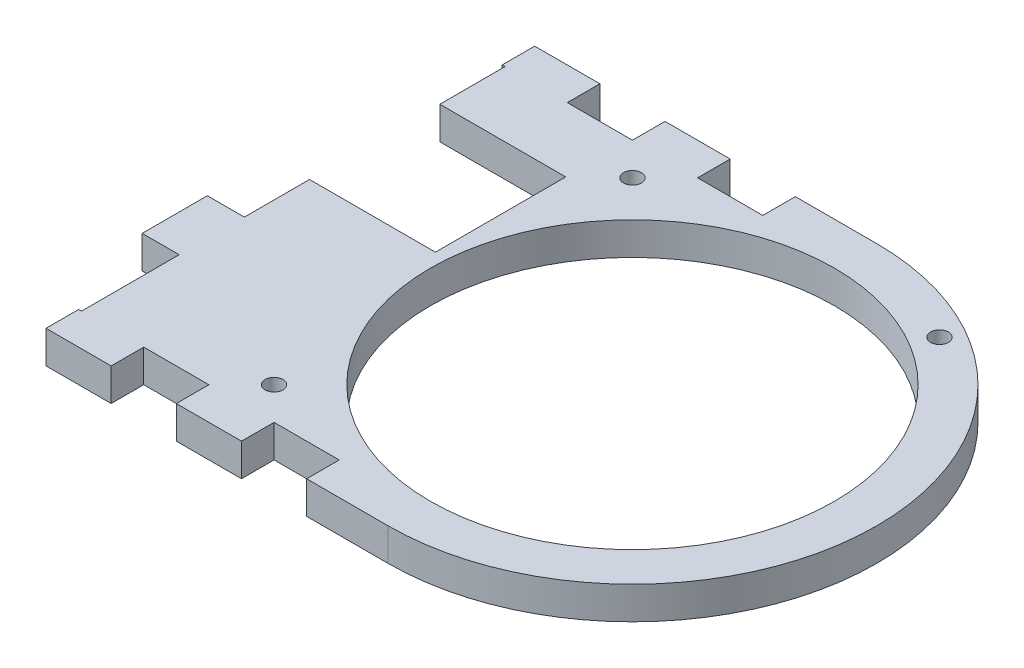
ISO-10303-21;
HEADER;
FILE_DESCRIPTION(('STEP AP214'),'2;1');
FILE_NAME('part.step','',(''),(''),'','','');
FILE_SCHEMA(('AUTOMOTIVE_DESIGN { 1 0 10303 214 1 1 1 1 }'));
ENDSEC;
DATA;
#1=APPLICATION_CONTEXT('core data for automotive mechanical design processes');
#2=APPLICATION_PROTOCOL_DEFINITION('international standard','automotive_design',2000,#1);
#3=PRODUCT_CONTEXT('',#1,'mechanical');
#4=PRODUCT('Part','Part','',(#3));
#5=PRODUCT_RELATED_PRODUCT_CATEGORY('part','',(#4));
#6=PRODUCT_DEFINITION_FORMATION('','',#4);
#7=PRODUCT_DEFINITION_CONTEXT('part definition',#1,'design');
#8=PRODUCT_DEFINITION('design','',#6,#7);
#9=PRODUCT_DEFINITION_SHAPE('','',#8);
#10=(LENGTH_UNIT() NAMED_UNIT(*) SI_UNIT(.MILLI.,.METRE.));
#11=(NAMED_UNIT(*) PLANE_ANGLE_UNIT() SI_UNIT($,.RADIAN.));
#12=(NAMED_UNIT(*) SI_UNIT($,.STERADIAN.) SOLID_ANGLE_UNIT());
#13=UNCERTAINTY_MEASURE_WITH_UNIT(LENGTH_MEASURE(1.E-05),#10,'distance_accuracy_value','');
#14=(GEOMETRIC_REPRESENTATION_CONTEXT(3) GLOBAL_UNCERTAINTY_ASSIGNED_CONTEXT((#13)) GLOBAL_UNIT_ASSIGNED_CONTEXT((#10,
#11,#12)) REPRESENTATION_CONTEXT('',''));
#15=CARTESIAN_POINT('',(0.,0.,0.));
#16=DIRECTION('',(0.,0.,1.));
#17=DIRECTION('',(1.,0.,0.));
#18=AXIS2_PLACEMENT_3D('',#15,#16,#17);
#19=CARTESIAN_POINT('',(0.,0.,95.25));
#20=DIRECTION('',(0.,0.,1.));
#21=DIRECTION('',(1.,0.,0.));
#22=AXIS2_PLACEMENT_3D('',#19,#20,#21);
#23=PLANE('',#22);
#24=DIRECTION('',(0.,1.,0.));
#25=VECTOR('',#24,1.);
#26=CARTESIAN_POINT('',(44.9585417845309,0.,95.250000000014));
#27=LINE('',#26,#25);
#28=CARTESIAN_POINT('',(44.9585417845309,0.,95.250000000014));
#29=VERTEX_POINT('',#28);
#30=CARTESIAN_POINT('',(44.9585417845309,6.34999999999999,95.250000000014));
#31=VERTEX_POINT('',#30);
#32=EDGE_CURVE('E438',#29,#31,#27,.T.);
#33=ORIENTED_EDGE('',*,*,#32,.F.);
#34=DIRECTION('',(1.,0.,0.));
#35=VECTOR('',#34,1.);
#36=CARTESIAN_POINT('',(159.258541784531,0.,95.25));
#37=LINE('',#36,#35);
#38=CARTESIAN_POINT('',(57.6585417845309,0.,95.250000000007));
#39=VERTEX_POINT('',#38);
#40=EDGE_CURVE('E265',#29,#39,#37,.T.);
#41=ORIENTED_EDGE('',*,*,#40,.T.);
#42=DIRECTION('',(0.,1.,0.));
#43=VECTOR('',#42,1.);
#44=CARTESIAN_POINT('',(57.6585417845309,0.,95.250000000007));
#45=LINE('',#44,#43);
#46=CARTESIAN_POINT('',(57.6585417845309,6.34999999999999,95.250000000007));
#47=VERTEX_POINT('',#46);
#48=EDGE_CURVE('E401',#39,#47,#45,.T.);
#49=ORIENTED_EDGE('',*,*,#48,.T.);
#50=DIRECTION('',(-1.,0.,0.));
#51=VECTOR('',#50,1.);
#52=CARTESIAN_POINT('',(159.258541784531,6.35,95.25));
#53=LINE('',#52,#51);
#54=EDGE_CURVE('E272',#47,#31,#53,.T.);
#55=ORIENTED_EDGE('',*,*,#54,.T.);
#56=EDGE_LOOP('',(#33,#41,#49,#55));
#57=FACE_BOUND('',#56,.T.);
#58=ADVANCED_FACE('F33',(#57),#23,.T.);
#59=CARTESIAN_POINT('',(0.,0.,0.));
#60=DIRECTION('',(0.,0.,1.));
#61=DIRECTION('',(1.,0.,0.));
#62=AXIS2_PLACEMENT_3D('',#59,#60,#61);
#63=PLANE('',#62);
#64=DIRECTION('',(1.,0.,0.));
#65=VECTOR('',#64,1.);
#66=CARTESIAN_POINT('',(159.258541784531,0.,0.));
#67=LINE('',#66,#65);
#68=CARTESIAN_POINT('',(70.3585417845309,0.,-5.33004317040475E-12));
#69=VERTEX_POINT('',#68);
#70=CARTESIAN_POINT('',(83.0585417845309,0.,0.));
#71=VERTEX_POINT('',#70);
#72=EDGE_CURVE('E273',#69,#71,#67,.T.);
#73=ORIENTED_EDGE('',*,*,#72,.F.);
#74=DIRECTION('',(0.,1.,0.));
#75=VECTOR('',#74,1.);
#76=CARTESIAN_POINT('',(70.3585417845309,0.,-5.33004317040475E-12));
#77=LINE('',#76,#75);
#78=CARTESIAN_POINT('',(70.3585417845309,6.34999999999999,-5.33004317040475E-12));
#79=VERTEX_POINT('',#78);
#80=EDGE_CURVE('E375',#69,#79,#77,.T.);
#81=ORIENTED_EDGE('',*,*,#80,.T.);
#82=DIRECTION('',(-1.,0.,0.));
#83=VECTOR('',#82,1.);
#84=CARTESIAN_POINT('',(159.258541784531,6.35,0.));
#85=LINE('',#84,#83);
#86=CARTESIAN_POINT('',(83.0585417845309,6.34999999999999,-1.23219202719043E-11));
#87=VERTEX_POINT('',#86);
#88=EDGE_CURVE('E277',#87,#79,#85,.T.);
#89=ORIENTED_EDGE('',*,*,#88,.F.);
#90=DIRECTION('',(0.,1.,0.));
#91=VECTOR('',#90,1.);
#92=CARTESIAN_POINT('',(83.0585417845309,0.,-1.23219202719043E-11));
#93=LINE('',#92,#91);
#94=EDGE_CURVE('E326',#71,#87,#93,.T.);
#95=ORIENTED_EDGE('',*,*,#94,.F.);
#96=EDGE_LOOP('',(#73,#81,#89,#95));
#97=FACE_BOUND('',#96,.T.);
#98=ADVANCED_FACE('F596',(#97),#63,.F.);
#99=DIRECTION('',(0.,1.,0.));
#100=VECTOR('',#99,1.);
#101=CARTESIAN_POINT('',(70.3585417845309,0.,95.250000000007));
#102=LINE('',#101,#100);
#103=CARTESIAN_POINT('',(70.3585417845309,0.,95.250000000007));
#104=VERTEX_POINT('',#103);
#105=CARTESIAN_POINT('',(70.3585417845309,6.34999999999999,95.250000000007));
#106=VERTEX_POINT('',#105);
#107=EDGE_CURVE('E404',#104,#106,#102,.T.);
#108=ORIENTED_EDGE('',*,*,#107,.F.);
#109=CARTESIAN_POINT('',(83.0585417845309,0.,95.25));
#110=VERTEX_POINT('',#109);
#111=EDGE_CURVE('E266',#104,#110,#37,.T.);
#112=ORIENTED_EDGE('',*,*,#111,.T.);
#113=DIRECTION('',(0.,1.,0.));
#114=VECTOR('',#113,1.);
#115=CARTESIAN_POINT('',(83.0585417845309,0.,95.25));
#116=LINE('',#115,#114);
#117=CARTESIAN_POINT('',(83.0585417845309,6.34999999999999,95.25));
#118=VERTEX_POINT('',#117);
#119=EDGE_CURVE('E349',#110,#118,#116,.T.);
#120=ORIENTED_EDGE('',*,*,#119,.T.);
#121=EDGE_CURVE('E283',#118,#106,#53,.T.);
#122=ORIENTED_EDGE('',*,*,#121,.T.);
#123=EDGE_LOOP('',(#108,#112,#120,#122));
#124=FACE_BOUND('',#123,.T.);
#125=ADVANCED_FACE('F563',(#124),#23,.T.);
#126=CARTESIAN_POINT('',(95.7585417845309,0.,-1.23234755733392E-11));
#127=VERTEX_POINT('',#126);
#128=CARTESIAN_POINT('',(111.633541784531,0.,0.));
#129=VERTEX_POINT('',#128);
#130=EDGE_CURVE('E274',#127,#129,#67,.T.);
#131=ORIENTED_EDGE('',*,*,#130,.F.);
#132=DIRECTION('',(0.,1.,0.));
#133=VECTOR('',#132,1.);
#134=CARTESIAN_POINT('',(95.7585417845309,0.,-1.23234755733392E-11));
#135=LINE('',#134,#133);
#136=CARTESIAN_POINT('',(95.7585417845309,6.34999999999999,-1.23234755733392E-11));
#137=VERTEX_POINT('',#136);
#138=EDGE_CURVE('E323',#127,#137,#135,.T.);
#139=ORIENTED_EDGE('',*,*,#138,.T.);
#140=CARTESIAN_POINT('',(111.633541784531,6.34999999999999,-1.23234755733392E-11));
#141=VERTEX_POINT('',#140);
#142=EDGE_CURVE('E275',#141,#137,#85,.T.);
#143=ORIENTED_EDGE('',*,*,#142,.F.);
#144=DIRECTION('',(0.,1.,0.));
#145=VECTOR('',#144,1.);
#146=CARTESIAN_POINT('',(111.633541784531,0.,-1.23234755733392E-11));
#147=LINE('',#146,#145);
#148=EDGE_CURVE('E288',#129,#141,#147,.T.);
#149=ORIENTED_EDGE('',*,*,#148,.F.);
#150=EDGE_LOOP('',(#131,#139,#143,#149));
#151=FACE_BOUND('',#150,.T.);
#152=ADVANCED_FACE('F517',(#151),#63,.F.);
#153=CARTESIAN_POINT('',(159.258541784531,6.35,95.25));
#154=DIRECTION('',(0.,-1.,0.));
#155=DIRECTION('',(1.,0.,0.));
#156=AXIS2_PLACEMENT_3D('',#153,#154,#155);
#157=PLANE('',#156);
#158=CARTESIAN_POINT('',(133.541041784534,6.35,9.68009693317952));
#159=DIRECTION('',(0.,1.,0.));
#160=DIRECTION('',(-1.,0.,0.));
#161=AXIS2_PLACEMENT_3D('',#158,#159,#160);
#162=CIRCLE('',#161,1.75000000000001);
#163=CARTESIAN_POINT('',(131.791041784534,6.35,9.68009693317952));
#164=VERTEX_POINT('',#163);
#165=EDGE_CURVE('E500',#164,#164,#162,.T.);
#166=ORIENTED_EDGE('',*,*,#165,.F.);
#167=EDGE_LOOP('',(#166));
#168=FACE_BOUND('',#167,.T.);
#169=CARTESIAN_POINT('',(76.7085417845309,6.34999999999999,82.55));
#170=DIRECTION('',(0.,1.,0.));
#171=DIRECTION('',(-1.,0.,0.));
#172=AXIS2_PLACEMENT_3D('',#169,#170,#171);
#173=CIRCLE('',#172,1.75);
#174=CARTESIAN_POINT('',(74.9585417845309,6.34999999999999,82.55));
#175=VERTEX_POINT('',#174);
#176=EDGE_CURVE('E494',#175,#175,#173,.T.);
#177=ORIENTED_EDGE('',*,*,#176,.F.);
#178=EDGE_LOOP('',(#177));
#179=FACE_BOUND('',#178,.T.);
#180=CARTESIAN_POINT('',(76.7085417845309,6.34999999999999,12.7));
#181=DIRECTION('',(0.,1.,0.));
#182=DIRECTION('',(-1.,0.,0.));
#183=AXIS2_PLACEMENT_3D('',#180,#181,#182);
#184=CIRCLE('',#183,1.75);
#185=CARTESIAN_POINT('',(74.9585417845309,6.34999999999999,12.7));
#186=VERTEX_POINT('',#185);
#187=EDGE_CURVE('E488',#186,#186,#184,.T.);
#188=ORIENTED_EDGE('',*,*,#187,.F.);
#189=EDGE_LOOP('',(#188));
#190=FACE_BOUND('',#189,.T.);
#191=CARTESIAN_POINT('',(111.633541784531,6.34999999999999,47.625));
#192=DIRECTION('',(0.,1.,0.));
#193=DIRECTION('',(-1.,0.,0.));
#194=AXIS2_PLACEMENT_3D('',#191,#192,#193);
#195=CIRCLE('',#194,39.37);
#196=CARTESIAN_POINT('',(72.2635417845309,6.34999999999999,47.625));
#197=VERTEX_POINT('',#196);
#198=EDGE_CURVE('E284',#197,#197,#195,.T.);
#199=ORIENTED_EDGE('',*,*,#198,.F.);
#200=EDGE_LOOP('',(#199));
#201=FACE_BOUND('',#200,.T.);
#202=DIRECTION('',(1.,0.,0.));
#203=VECTOR('',#202,1.);
#204=CARTESIAN_POINT('',(38.3055854572426,6.34999999999999,44.45));
#205=LINE('',#204,#203);
#206=CARTESIAN_POINT('',(45.5181771869598,6.34999999999999,44.45));
#207=VERTEX_POINT('',#206);
#208=CARTESIAN_POINT('',(70.0555854572427,6.34999999999999,44.45));
#209=VERTEX_POINT('',#208);
#210=EDGE_CURVE('E314',#207,#209,#205,.T.);
#211=ORIENTED_EDGE('',*,*,#210,.F.);
#212=DIRECTION('',(0.,0.,-1.));
#213=VECTOR('',#212,1.);
#214=CARTESIAN_POINT('',(45.5181771869598,6.34999999999999,57.150000000007));
#215=LINE('',#214,#213);
#216=CARTESIAN_POINT('',(45.5181771869598,6.34999999999999,57.150000000007));
#217=VERTEX_POINT('',#216);
#218=EDGE_CURVE('E48',#217,#207,#215,.T.);
#219=ORIENTED_EDGE('',*,*,#218,.F.);
#220=DIRECTION('',(1.,0.,0.));
#221=VECTOR('',#220,1.);
#222=CARTESIAN_POINT('',(38.3055854572427,6.34999999999999,57.150000000007));
#223=LINE('',#222,#221);
#224=CARTESIAN_POINT('',(38.3055854572427,6.34999999999999,57.150000000007));
#225=VERTEX_POINT('',#224);
#226=EDGE_CURVE('E484',#225,#217,#223,.T.);
#227=ORIENTED_EDGE('',*,*,#226,.F.);
#228=DIRECTION('',(0.,0.,-1.));
#229=VECTOR('',#228,1.);
#230=CARTESIAN_POINT('',(38.3055854572427,6.34999999999999,95.25));
#231=LINE('',#230,#229);
#232=CARTESIAN_POINT('',(38.3055854572427,6.34999999999999,69.850000000007));
#233=VERTEX_POINT('',#232);
#234=EDGE_CURVE('E11',#233,#225,#231,.T.);
#235=ORIENTED_EDGE('',*,*,#234,.F.);
#236=DIRECTION('',(-1.,0.,0.));
#237=VECTOR('',#236,1.);
#238=CARTESIAN_POINT('',(38.3055854572427,6.34999999999999,69.850000000007));
#239=LINE('',#238,#237);
#240=CARTESIAN_POINT('',(45.5181771869598,6.34999999999999,69.850000000007));
#241=VERTEX_POINT('',#240);
#242=EDGE_CURVE('E469',#241,#233,#239,.T.);
#243=ORIENTED_EDGE('',*,*,#242,.F.);
#244=DIRECTION('',(0.,0.,-1.));
#245=VECTOR('',#244,1.);
#246=CARTESIAN_POINT('',(45.5181771869598,6.34999999999999,88.900000000014));
#247=LINE('',#246,#245);
#248=CARTESIAN_POINT('',(45.5181771869598,6.34999999999999,88.900000000014));
#249=VERTEX_POINT('',#248);
#250=EDGE_CURVE('E471',#249,#241,#247,.T.);
#251=ORIENTED_EDGE('',*,*,#250,.F.);
#252=DIRECTION('',(1.,0.,0.));
#253=VECTOR('',#252,1.);
#254=CARTESIAN_POINT('',(38.3055854572427,6.34999999999999,88.900000000014));
#255=LINE('',#254,#253);
#256=CARTESIAN_POINT('',(44.9585417845309,6.34999999999999,88.900000000014));
#257=VERTEX_POINT('',#256);
#258=EDGE_CURVE('E474',#257,#249,#255,.T.);
#259=ORIENTED_EDGE('',*,*,#258,.F.);
#260=DIRECTION('',(0.,0.,-1.));
#261=VECTOR('',#260,1.);
#262=CARTESIAN_POINT('',(44.9585417845309,6.34999999999999,95.250000000014));
#263=LINE('',#262,#261);
#264=EDGE_CURVE('E442',#31,#257,#263,.T.);
#265=ORIENTED_EDGE('',*,*,#264,.F.);
#266=ORIENTED_EDGE('',*,*,#54,.F.);
#267=DIRECTION('',(0.,0.,1.));
#268=VECTOR('',#267,1.);
#269=CARTESIAN_POINT('',(57.6585417845309,6.34999999999999,95.250000000007));
#270=LINE('',#269,#268);
#271=CARTESIAN_POINT('',(57.6585417845309,6.34999999999999,88.900000000007));
#272=VERTEX_POINT('',#271);
#273=EDGE_CURVE('E417',#272,#47,#270,.T.);
#274=ORIENTED_EDGE('',*,*,#273,.F.);
#275=DIRECTION('',(-1.,0.,0.));
#276=VECTOR('',#275,1.);
#277=CARTESIAN_POINT('',(57.6585417845309,6.34999999999999,88.900000000007));
#278=LINE('',#277,#276);
#279=CARTESIAN_POINT('',(70.3585417845309,6.34999999999999,88.900000000007));
#280=VERTEX_POINT('',#279);
#281=EDGE_CURVE('E410',#280,#272,#278,.T.);
#282=ORIENTED_EDGE('',*,*,#281,.F.);
#283=DIRECTION('',(0.,0.,-1.));
#284=VECTOR('',#283,1.);
#285=CARTESIAN_POINT('',(70.3585417845309,6.34999999999999,95.250000000007));
#286=LINE('',#285,#284);
#287=EDGE_CURVE('E414',#106,#280,#286,.T.);
#288=ORIENTED_EDGE('',*,*,#287,.F.);
#289=ORIENTED_EDGE('',*,*,#121,.F.);
#290=DIRECTION('',(0.,0.,1.));
#291=VECTOR('',#290,1.);
#292=CARTESIAN_POINT('',(83.0585417845309,6.34999999999999,95.25));
#293=LINE('',#292,#291);
#294=CARTESIAN_POINT('',(83.0585417845309,6.34999999999999,88.9));
#295=VERTEX_POINT('',#294);
#296=EDGE_CURVE('E365',#295,#118,#293,.T.);
#297=ORIENTED_EDGE('',*,*,#296,.F.);
#298=DIRECTION('',(-1.,0.,0.));
#299=VECTOR('',#298,1.);
#300=CARTESIAN_POINT('',(83.0585417845309,6.34999999999999,88.9));
#301=LINE('',#300,#299);
#302=CARTESIAN_POINT('',(95.7585417845309,6.34999999999999,88.9));
#303=VERTEX_POINT('',#302);
#304=EDGE_CURVE('E358',#303,#295,#301,.T.);
#305=ORIENTED_EDGE('',*,*,#304,.F.);
#306=DIRECTION('',(0.,0.,-1.));
#307=VECTOR('',#306,1.);
#308=CARTESIAN_POINT('',(95.7585417845309,6.34999999999999,95.25));
#309=LINE('',#308,#307);
#310=CARTESIAN_POINT('',(95.7585417845309,6.34999999999999,95.25));
#311=VERTEX_POINT('',#310);
#312=EDGE_CURVE('E362',#311,#303,#309,.T.);
#313=ORIENTED_EDGE('',*,*,#312,.F.);
#314=CARTESIAN_POINT('',(111.633541784531,6.34999999999999,95.25));
#315=VERTEX_POINT('',#314);
#316=EDGE_CURVE('E280',#315,#311,#53,.T.);
#317=ORIENTED_EDGE('',*,*,#316,.F.);
#318=CARTESIAN_POINT('',(111.633541784531,6.34999999999999,47.625));
#319=DIRECTION('',(0.,-1.,0.));
#320=DIRECTION('',(-1.,0.,0.));
#321=AXIS2_PLACEMENT_3D('',#318,#319,#320);
#322=CIRCLE('',#321,47.6250000000062);
#323=EDGE_CURVE('E297',#141,#315,#322,.T.);
#324=ORIENTED_EDGE('',*,*,#323,.F.);
#325=ORIENTED_EDGE('',*,*,#142,.T.);
#326=DIRECTION('',(0.,0.,-1.));
#327=VECTOR('',#326,1.);
#328=CARTESIAN_POINT('',(95.7585417845309,6.34999999999999,-1.23234755733392E-11));
#329=LINE('',#328,#327);
#330=CARTESIAN_POINT('',(95.7585417845309,6.34999999999999,6.34999999998768));
#331=VERTEX_POINT('',#330);
#332=EDGE_CURVE('E339',#331,#137,#329,.T.);
#333=ORIENTED_EDGE('',*,*,#332,.F.);
#334=DIRECTION('',(1.,0.,0.));
#335=VECTOR('',#334,1.);
#336=CARTESIAN_POINT('',(95.7585417845309,6.34999999999999,6.34999999998768));
#337=LINE('',#336,#335);
#338=CARTESIAN_POINT('',(83.0585417845309,6.34999999999999,6.34999999998768));
#339=VERTEX_POINT('',#338);
#340=EDGE_CURVE('E332',#339,#331,#337,.T.);
#341=ORIENTED_EDGE('',*,*,#340,.F.);
#342=DIRECTION('',(0.,0.,1.));
#343=VECTOR('',#342,1.);
#344=CARTESIAN_POINT('',(83.0585417845309,6.34999999999999,-1.23219202719043E-11));
#345=LINE('',#344,#343);
#346=EDGE_CURVE('E336',#87,#339,#345,.T.);
#347=ORIENTED_EDGE('',*,*,#346,.F.);
#348=ORIENTED_EDGE('',*,*,#88,.T.);
#349=DIRECTION('',(0.,0.,-1.));
#350=VECTOR('',#349,1.);
#351=CARTESIAN_POINT('',(70.3585417845309,6.34999999999999,-5.33004317040475E-12));
#352=LINE('',#351,#350);
#353=CARTESIAN_POINT('',(70.3585417845309,6.34999999999999,6.34999999999467));
#354=VERTEX_POINT('',#353);
#355=EDGE_CURVE('E391',#354,#79,#352,.T.);
#356=ORIENTED_EDGE('',*,*,#355,.F.);
#357=DIRECTION('',(1.,0.,0.));
#358=VECTOR('',#357,1.);
#359=CARTESIAN_POINT('',(70.3585417845309,6.34999999999999,6.34999999999467));
#360=LINE('',#359,#358);
#361=CARTESIAN_POINT('',(57.6585417845309,6.34999999999999,6.34999999999467));
#362=VERTEX_POINT('',#361);
#363=EDGE_CURVE('E384',#362,#354,#360,.T.);
#364=ORIENTED_EDGE('',*,*,#363,.F.);
#365=DIRECTION('',(0.,0.,1.));
#366=VECTOR('',#365,1.);
#367=CARTESIAN_POINT('',(57.6585417845309,6.34999999999999,-5.32848786896983E-12));
#368=LINE('',#367,#366);
#369=CARTESIAN_POINT('',(57.6585417845309,6.34999999999999,-5.32848786896983E-12));
#370=VERTEX_POINT('',#369);
#371=EDGE_CURVE('E388',#370,#362,#368,.T.);
#372=ORIENTED_EDGE('',*,*,#371,.F.);
#373=CARTESIAN_POINT('',(44.9585417845309,6.34999999999999,0.));
#374=VERTEX_POINT('',#373);
#375=EDGE_CURVE('E278',#370,#374,#85,.T.);
#376=ORIENTED_EDGE('',*,*,#375,.T.);
#377=DIRECTION('',(0.,0.,-1.));
#378=VECTOR('',#377,1.);
#379=CARTESIAN_POINT('',(44.9585417845309,6.34999999999999,1.66338923252974E-12));
#380=LINE('',#379,#378);
#381=CARTESIAN_POINT('',(44.9585417845309,6.34999999999999,6.35000000000166));
#382=VERTEX_POINT('',#381);
#383=EDGE_CURVE('E433',#382,#374,#380,.T.);
#384=ORIENTED_EDGE('',*,*,#383,.F.);
#385=DIRECTION('',(-1.,0.,0.));
#386=VECTOR('',#385,1.);
#387=CARTESIAN_POINT('',(38.3055854572427,6.34999999999999,6.35000000000166));
#388=LINE('',#387,#386);
#389=CARTESIAN_POINT('',(45.5181771869598,6.34999999999999,6.35000000000166));
#390=VERTEX_POINT('',#389);
#391=EDGE_CURVE('E452',#390,#382,#388,.T.);
#392=ORIENTED_EDGE('',*,*,#391,.F.);
#393=DIRECTION('',(0.,0.,-1.));
#394=VECTOR('',#393,1.);
#395=CARTESIAN_POINT('',(45.5181771869598,6.34999999999999,6.35000000000166));
#396=LINE('',#395,#394);
#397=CARTESIAN_POINT('',(45.5181771869598,6.34999999999999,19.05));
#398=VERTEX_POINT('',#397);
#399=EDGE_CURVE('E455',#398,#390,#396,.T.);
#400=ORIENTED_EDGE('',*,*,#399,.F.);
#401=DIRECTION('',(-1.,0.,0.));
#402=VECTOR('',#401,1.);
#403=CARTESIAN_POINT('',(38.3055854572427,6.34999999999999,19.05));
#404=LINE('',#403,#402);
#405=CARTESIAN_POINT('',(70.0555854572427,6.34999999999999,19.05));
#406=VERTEX_POINT('',#405);
#407=EDGE_CURVE('E307',#406,#398,#404,.T.);
#408=ORIENTED_EDGE('',*,*,#407,.F.);
#409=DIRECTION('',(0.,0.,-1.));
#410=VECTOR('',#409,1.);
#411=CARTESIAN_POINT('',(70.0555854572427,6.34999999999999,19.05));
#412=LINE('',#411,#410);
#413=EDGE_CURVE('E311',#209,#406,#412,.T.);
#414=ORIENTED_EDGE('',*,*,#413,.F.);
#415=EDGE_LOOP('',(#211,#219,#227,#235,#243,#251,#259,#265,#266,#274,#282,#288,#289,#297,#305,
#313,#317,#324,#325,#333,#341,#347,#348,#356,#364,#372,#376,#384,#392,#400,#408,#414));
#416=FACE_BOUND('',#415,.T.);
#417=ADVANCED_FACE('F35',(#168,#179,#190,#201,#416),#157,.F.);
#418=CARTESIAN_POINT('',(38.3055854572427,0.,95.25));
#419=DIRECTION('',(1.,0.,0.));
#420=DIRECTION('',(0.,0.,-1.));
#421=AXIS2_PLACEMENT_3D('',#418,#419,#420);
#422=PLANE('',#421);
#423=ORIENTED_EDGE('',*,*,#234,.T.);
#424=DIRECTION('',(0.,1.,0.));
#425=VECTOR('',#424,1.);
#426=CARTESIAN_POINT('',(38.3055854572427,0.,57.150000000007));
#427=LINE('',#426,#425);
#428=CARTESIAN_POINT('',(38.3055854572427,0.,57.150000000007));
#429=VERTEX_POINT('',#428);
#430=EDGE_CURVE('E245',#429,#225,#427,.T.);
#431=ORIENTED_EDGE('',*,*,#430,.F.);
#432=DIRECTION('',(0.,0.,-1.));
#433=VECTOR('',#432,1.);
#434=CARTESIAN_POINT('',(38.3055854572427,0.,95.25));
#435=LINE('',#434,#433);
#436=CARTESIAN_POINT('',(38.3055854572427,0.,69.850000000007));
#437=VERTEX_POINT('',#436);
#438=EDGE_CURVE('E41',#437,#429,#435,.T.);
#439=ORIENTED_EDGE('',*,*,#438,.F.);
#440=DIRECTION('',(0.,1.,0.));
#441=VECTOR('',#440,1.);
#442=CARTESIAN_POINT('',(38.3055854572427,0.,69.850000000007));
#443=LINE('',#442,#441);
#444=EDGE_CURVE('E458',#437,#233,#443,.T.);
#445=ORIENTED_EDGE('',*,*,#444,.T.);
#446=EDGE_LOOP('',(#423,#431,#439,#445));
#447=FACE_BOUND('',#446,.T.);
#448=ADVANCED_FACE('F256',(#447),#422,.F.);
#449=CARTESIAN_POINT('',(159.258541784531,0.,95.25));
#450=DIRECTION('',(0.,1.,0.));
#451=DIRECTION('',(-1.,0.,0.));
#452=AXIS2_PLACEMENT_3D('',#449,#450,#451);
#453=PLANE('',#452);
#454=CARTESIAN_POINT('',(133.541041784534,0.,9.68009693317952));
#455=DIRECTION('',(0.,1.,0.));
#456=DIRECTION('',(-1.,0.,0.));
#457=AXIS2_PLACEMENT_3D('',#454,#455,#456);
#458=CIRCLE('',#457,1.75000000000001);
#459=CARTESIAN_POINT('',(131.791041784534,0.,9.68009693317952));
#460=VERTEX_POINT('',#459);
#461=EDGE_CURVE('E497',#460,#460,#458,.T.);
#462=ORIENTED_EDGE('',*,*,#461,.T.);
#463=EDGE_LOOP('',(#462));
#464=FACE_BOUND('',#463,.T.);
#465=CARTESIAN_POINT('',(76.7085417845309,0.,82.55));
#466=DIRECTION('',(0.,1.,0.));
#467=DIRECTION('',(-1.,0.,0.));
#468=AXIS2_PLACEMENT_3D('',#465,#466,#467);
#469=CIRCLE('',#468,1.75);
#470=CARTESIAN_POINT('',(74.9585417845309,0.,82.55));
#471=VERTEX_POINT('',#470);
#472=EDGE_CURVE('E491',#471,#471,#469,.T.);
#473=ORIENTED_EDGE('',*,*,#472,.T.);
#474=EDGE_LOOP('',(#473));
#475=FACE_BOUND('',#474,.T.);
#476=CARTESIAN_POINT('',(76.7085417845309,0.,12.7));
#477=DIRECTION('',(0.,1.,0.));
#478=DIRECTION('',(-1.,0.,0.));
#479=AXIS2_PLACEMENT_3D('',#476,#477,#478);
#480=CIRCLE('',#479,1.75);
#481=CARTESIAN_POINT('',(74.9585417845309,0.,12.7));
#482=VERTEX_POINT('',#481);
#483=EDGE_CURVE('E486',#482,#482,#480,.T.);
#484=ORIENTED_EDGE('',*,*,#483,.T.);
#485=EDGE_LOOP('',(#484));
#486=FACE_BOUND('',#485,.T.);
#487=CARTESIAN_POINT('',(111.633541784531,0.,47.625));
#488=DIRECTION('',(0.,1.,0.));
#489=DIRECTION('',(-1.,0.,0.));
#490=AXIS2_PLACEMENT_3D('',#487,#488,#489);
#491=CIRCLE('',#490,39.37);
#492=CARTESIAN_POINT('',(72.2635417845309,0.,47.625));
#493=VERTEX_POINT('',#492);
#494=EDGE_CURVE('E287',#493,#493,#491,.T.);
#495=ORIENTED_EDGE('',*,*,#494,.T.);
#496=EDGE_LOOP('',(#495));
#497=FACE_BOUND('',#496,.T.);
#498=DIRECTION('',(1.,0.,0.));
#499=VECTOR('',#498,1.);
#500=CARTESIAN_POINT('',(38.3055854572427,0.,57.150000000007));
#501=LINE('',#500,#499);
#502=CARTESIAN_POINT('',(45.5181771869598,0.,57.150000000007));
#503=VERTEX_POINT('',#502);
#504=EDGE_CURVE('E241',#429,#503,#501,.T.);
#505=ORIENTED_EDGE('',*,*,#504,.T.);
#506=DIRECTION('',(0.,0.,-1.));
#507=VECTOR('',#506,1.);
#508=CARTESIAN_POINT('',(45.5181771869598,0.,57.150000000007));
#509=LINE('',#508,#507);
#510=CARTESIAN_POINT('',(45.5181771869598,0.,44.45));
#511=VERTEX_POINT('',#510);
#512=EDGE_CURVE('E252',#503,#511,#509,.T.);
#513=ORIENTED_EDGE('',*,*,#512,.T.);
#514=DIRECTION('',(1.,0.,0.));
#515=VECTOR('',#514,1.);
#516=CARTESIAN_POINT('',(38.3055854572426,0.,44.45));
#517=LINE('',#516,#515);
#518=CARTESIAN_POINT('',(70.0555854572427,0.,44.45));
#519=VERTEX_POINT('',#518);
#520=EDGE_CURVE('E310',#511,#519,#517,.T.);
#521=ORIENTED_EDGE('',*,*,#520,.T.);
#522=DIRECTION('',(0.,0.,-1.));
#523=VECTOR('',#522,1.);
#524=CARTESIAN_POINT('',(70.0555854572427,0.,19.05));
#525=LINE('',#524,#523);
#526=CARTESIAN_POINT('',(70.0555854572427,0.,19.05));
#527=VERTEX_POINT('',#526);
#528=EDGE_CURVE('E319',#519,#527,#525,.T.);
#529=ORIENTED_EDGE('',*,*,#528,.T.);
#530=DIRECTION('',(-1.,0.,0.));
#531=VECTOR('',#530,1.);
#532=CARTESIAN_POINT('',(38.3055854572427,0.,19.05));
#533=LINE('',#532,#531);
#534=CARTESIAN_POINT('',(45.5181771869598,0.,19.05));
#535=VERTEX_POINT('',#534);
#536=EDGE_CURVE('E305',#527,#535,#533,.T.);
#537=ORIENTED_EDGE('',*,*,#536,.T.);
#538=DIRECTION('',(0.,0.,-1.));
#539=VECTOR('',#538,1.);
#540=CARTESIAN_POINT('',(45.5181771869598,0.,6.35000000000166));
#541=LINE('',#540,#539);
#542=CARTESIAN_POINT('',(45.5181771869598,0.,6.35000000000166));
#543=VERTEX_POINT('',#542);
#544=EDGE_CURVE('E454',#535,#543,#541,.T.);
#545=ORIENTED_EDGE('',*,*,#544,.T.);
#546=DIRECTION('',(-1.,0.,0.));
#547=VECTOR('',#546,1.);
#548=CARTESIAN_POINT('',(38.3055854572427,0.,6.35000000000166));
#549=LINE('',#548,#547);
#550=CARTESIAN_POINT('',(44.9585417845309,0.,6.35000000000166));
#551=VERTEX_POINT('',#550);
#552=EDGE_CURVE('E450',#543,#551,#549,.T.);
#553=ORIENTED_EDGE('',*,*,#552,.T.);
#554=DIRECTION('',(0.,0.,-1.));
#555=VECTOR('',#554,1.);
#556=CARTESIAN_POINT('',(44.9585417845309,0.,1.66338923252974E-12));
#557=LINE('',#556,#555);
#558=CARTESIAN_POINT('',(44.9585417845309,0.,1.66338923252974E-12));
#559=VERTEX_POINT('',#558);
#560=EDGE_CURVE('E430',#551,#559,#557,.T.);
#561=ORIENTED_EDGE('',*,*,#560,.T.);
#562=CARTESIAN_POINT('',(57.6585417845309,0.,0.));
#563=VERTEX_POINT('',#562);
#564=EDGE_CURVE('E270',#559,#563,#67,.T.);
#565=ORIENTED_EDGE('',*,*,#564,.T.);
#566=DIRECTION('',(0.,0.,1.));
#567=VECTOR('',#566,1.);
#568=CARTESIAN_POINT('',(57.6585417845309,0.,-5.32848786896983E-12));
#569=LINE('',#568,#567);
#570=CARTESIAN_POINT('',(57.6585417845309,0.,6.34999999999467));
#571=VERTEX_POINT('',#570);
#572=EDGE_CURVE('E396',#563,#571,#569,.T.);
#573=ORIENTED_EDGE('',*,*,#572,.T.);
#574=DIRECTION('',(1.,0.,0.));
#575=VECTOR('',#574,1.);
#576=CARTESIAN_POINT('',(70.3585417845309,0.,6.34999999999467));
#577=LINE('',#576,#575);
#578=CARTESIAN_POINT('',(70.3585417845309,0.,6.34999999999467));
#579=VERTEX_POINT('',#578);
#580=EDGE_CURVE('E379',#571,#579,#577,.T.);
#581=ORIENTED_EDGE('',*,*,#580,.T.);
#582=DIRECTION('',(0.,0.,-1.));
#583=VECTOR('',#582,1.);
#584=CARTESIAN_POINT('',(70.3585417845309,0.,-5.33004317040475E-12));
#585=LINE('',#584,#583);
#586=EDGE_CURVE('E387',#579,#69,#585,.T.);
#587=ORIENTED_EDGE('',*,*,#586,.T.);
#588=ORIENTED_EDGE('',*,*,#72,.T.);
#589=DIRECTION('',(0.,0.,1.));
#590=VECTOR('',#589,1.);
#591=CARTESIAN_POINT('',(83.0585417845309,0.,-1.23219202719043E-11));
#592=LINE('',#591,#590);
#593=CARTESIAN_POINT('',(83.0585417845309,0.,6.34999999998768));
#594=VERTEX_POINT('',#593);
#595=EDGE_CURVE('E344',#71,#594,#592,.T.);
#596=ORIENTED_EDGE('',*,*,#595,.T.);
#597=DIRECTION('',(1.,0.,0.));
#598=VECTOR('',#597,1.);
#599=CARTESIAN_POINT('',(95.7585417845309,0.,6.34999999998768));
#600=LINE('',#599,#598);
#601=CARTESIAN_POINT('',(95.7585417845309,0.,6.34999999998768));
#602=VERTEX_POINT('',#601);
#603=EDGE_CURVE('E327',#594,#602,#600,.T.);
#604=ORIENTED_EDGE('',*,*,#603,.T.);
#605=DIRECTION('',(0.,0.,-1.));
#606=VECTOR('',#605,1.);
#607=CARTESIAN_POINT('',(95.7585417845309,0.,-1.23234755733392E-11));
#608=LINE('',#607,#606);
#609=EDGE_CURVE('E335',#602,#127,#608,.T.);
#610=ORIENTED_EDGE('',*,*,#609,.T.);
#611=ORIENTED_EDGE('',*,*,#130,.T.);
#612=CARTESIAN_POINT('',(111.633541784531,0.,47.625));
#613=DIRECTION('',(0.,-1.,0.));
#614=DIRECTION('',(-1.,0.,0.));
#615=AXIS2_PLACEMENT_3D('',#612,#613,#614);
#616=CIRCLE('',#615,47.6250000000062);
#617=CARTESIAN_POINT('',(111.633541784531,0.,95.25));
#618=VERTEX_POINT('',#617);
#619=EDGE_CURVE('E294',#129,#618,#616,.T.);
#620=ORIENTED_EDGE('',*,*,#619,.T.);
#621=CARTESIAN_POINT('',(95.7585417845309,0.,95.25));
#622=VERTEX_POINT('',#621);
#623=EDGE_CURVE('E268',#622,#618,#37,.T.);
#624=ORIENTED_EDGE('',*,*,#623,.F.);
#625=DIRECTION('',(0.,0.,-1.));
#626=VECTOR('',#625,1.);
#627=CARTESIAN_POINT('',(95.7585417845309,0.,95.25));
#628=LINE('',#627,#626);
#629=CARTESIAN_POINT('',(95.7585417845309,0.,88.9));
#630=VERTEX_POINT('',#629);
#631=EDGE_CURVE('E370',#622,#630,#628,.T.);
#632=ORIENTED_EDGE('',*,*,#631,.T.);
#633=DIRECTION('',(-1.,0.,0.));
#634=VECTOR('',#633,1.);
#635=CARTESIAN_POINT('',(83.0585417845309,0.,88.9));
#636=LINE('',#635,#634);
#637=CARTESIAN_POINT('',(83.0585417845309,0.,88.9));
#638=VERTEX_POINT('',#637);
#639=EDGE_CURVE('E353',#630,#638,#636,.T.);
#640=ORIENTED_EDGE('',*,*,#639,.T.);
#641=DIRECTION('',(0.,0.,1.));
#642=VECTOR('',#641,1.);
#643=CARTESIAN_POINT('',(83.0585417845309,0.,95.25));
#644=LINE('',#643,#642);
#645=EDGE_CURVE('E361',#638,#110,#644,.T.);
#646=ORIENTED_EDGE('',*,*,#645,.T.);
#647=ORIENTED_EDGE('',*,*,#111,.F.);
#648=DIRECTION('',(0.,0.,-1.));
#649=VECTOR('',#648,1.);
#650=CARTESIAN_POINT('',(70.3585417845309,0.,95.250000000007));
#651=LINE('',#650,#649);
#652=CARTESIAN_POINT('',(70.3585417845309,0.,88.900000000007));
#653=VERTEX_POINT('',#652);
#654=EDGE_CURVE('E422',#104,#653,#651,.T.);
#655=ORIENTED_EDGE('',*,*,#654,.T.);
#656=DIRECTION('',(-1.,0.,0.));
#657=VECTOR('',#656,1.);
#658=CARTESIAN_POINT('',(57.6585417845309,0.,88.900000000007));
#659=LINE('',#658,#657);
#660=CARTESIAN_POINT('',(57.6585417845309,0.,88.900000000007));
#661=VERTEX_POINT('',#660);
#662=EDGE_CURVE('E405',#653,#661,#659,.T.);
#663=ORIENTED_EDGE('',*,*,#662,.T.);
#664=DIRECTION('',(0.,0.,1.));
#665=VECTOR('',#664,1.);
#666=CARTESIAN_POINT('',(57.6585417845309,0.,95.250000000007));
#667=LINE('',#666,#665);
#668=EDGE_CURVE('E413',#661,#39,#667,.T.);
#669=ORIENTED_EDGE('',*,*,#668,.T.);
#670=ORIENTED_EDGE('',*,*,#40,.F.);
#671=DIRECTION('',(0.,0.,-1.));
#672=VECTOR('',#671,1.);
#673=CARTESIAN_POINT('',(44.9585417845309,0.,95.250000000014));
#674=LINE('',#673,#672);
#675=CARTESIAN_POINT('',(44.9585417845309,0.,88.900000000014));
#676=VERTEX_POINT('',#675);
#677=EDGE_CURVE('E440',#29,#676,#674,.T.);
#678=ORIENTED_EDGE('',*,*,#677,.T.);
#679=DIRECTION('',(1.,0.,0.));
#680=VECTOR('',#679,1.);
#681=CARTESIAN_POINT('',(38.3055854572427,0.,88.900000000014));
#682=LINE('',#681,#680);
#683=CARTESIAN_POINT('',(45.5181771869598,0.,88.900000000014));
#684=VERTEX_POINT('',#683);
#685=EDGE_CURVE('E56',#676,#684,#682,.T.);
#686=ORIENTED_EDGE('',*,*,#685,.T.);
#687=DIRECTION('',(0.,0.,-1.));
#688=VECTOR('',#687,1.);
#689=CARTESIAN_POINT('',(45.5181771869598,0.,88.900000000014));
#690=LINE('',#689,#688);
#691=CARTESIAN_POINT('',(45.5181771869598,0.,69.850000000007));
#692=VERTEX_POINT('',#691);
#693=EDGE_CURVE('E478',#684,#692,#690,.T.);
#694=ORIENTED_EDGE('',*,*,#693,.T.);
#695=DIRECTION('',(-1.,0.,0.));
#696=VECTOR('',#695,1.);
#697=CARTESIAN_POINT('',(38.3055854572427,0.,69.850000000007));
#698=LINE('',#697,#696);
#699=EDGE_CURVE('E264',#692,#437,#698,.T.);
#700=ORIENTED_EDGE('',*,*,#699,.T.);
#701=ORIENTED_EDGE('',*,*,#438,.T.);
#702=EDGE_LOOP('',(#505,#513,#521,#529,#537,#545,#553,#561,#565,#573,#581,#587,#588,#596,#604,
#610,#611,#620,#624,#632,#640,#646,#647,#655,#663,#669,#670,#678,#686,#694,#700,#701));
#703=FACE_BOUND('',#702,.T.);
#704=ADVANCED_FACE('F261',(#464,#475,#486,#497,#703),#453,.F.);
#705=DIRECTION('',(0.,1.,0.));
#706=VECTOR('',#705,1.);
#707=CARTESIAN_POINT('',(95.7585417845309,0.,95.25));
#708=LINE('',#707,#706);
#709=EDGE_CURVE('E352',#622,#311,#708,.T.);
#710=ORIENTED_EDGE('',*,*,#709,.F.);
#711=ORIENTED_EDGE('',*,*,#623,.T.);
#712=DIRECTION('',(0.,1.,0.));
#713=VECTOR('',#712,1.);
#714=CARTESIAN_POINT('',(111.633541784531,0.,95.25));
#715=LINE('',#714,#713);
#716=EDGE_CURVE('E291',#618,#315,#715,.T.);
#717=ORIENTED_EDGE('',*,*,#716,.T.);
#718=ORIENTED_EDGE('',*,*,#316,.T.);
#719=EDGE_LOOP('',(#710,#711,#717,#718));
#720=FACE_BOUND('',#719,.T.);
#721=ADVANCED_FACE('F577',(#720),#23,.T.);
#722=ORIENTED_EDGE('',*,*,#564,.F.);
#723=DIRECTION('',(0.,1.,0.));
#724=VECTOR('',#723,1.);
#725=CARTESIAN_POINT('',(44.9585417845309,0.,1.66338923252974E-12));
#726=LINE('',#725,#724);
#727=EDGE_CURVE('E427',#559,#374,#726,.T.);
#728=ORIENTED_EDGE('',*,*,#727,.T.);
#729=ORIENTED_EDGE('',*,*,#375,.F.);
#730=DIRECTION('',(0.,1.,0.));
#731=VECTOR('',#730,1.);
#732=CARTESIAN_POINT('',(57.6585417845309,0.,-5.32848786896983E-12));
#733=LINE('',#732,#731);
#734=EDGE_CURVE('E378',#563,#370,#733,.T.);
#735=ORIENTED_EDGE('',*,*,#734,.F.);
#736=EDGE_LOOP('',(#722,#728,#729,#735));
#737=FACE_BOUND('',#736,.T.);
#738=ADVANCED_FACE('F608',(#737),#63,.F.);
#739=CARTESIAN_POINT('',(111.633541784531,0.,47.625));
#740=DIRECTION('',(0.,1.,0.));
#741=DIRECTION('',(-1.,0.,0.));
#742=AXIS2_PLACEMENT_3D('',#739,#740,#741);
#743=CYLINDRICAL_SURFACE('',#742,39.37);
#744=ORIENTED_EDGE('',*,*,#494,.F.);
#745=EDGE_LOOP('',(#744));
#746=FACE_BOUND('',#745,.T.);
#747=ORIENTED_EDGE('',*,*,#198,.T.);
#748=EDGE_LOOP('',(#747));
#749=FACE_BOUND('',#748,.T.);
#750=ADVANCED_FACE('F644',(#746,#749),#743,.F.);
#751=CARTESIAN_POINT('',(111.633541784531,0.,47.625));
#752=DIRECTION('',(0.,1.,0.));
#753=DIRECTION('',(-1.,0.,0.));
#754=AXIS2_PLACEMENT_3D('',#751,#752,#753);
#755=CYLINDRICAL_SURFACE('',#754,47.6250000000062);
#756=ORIENTED_EDGE('',*,*,#323,.T.);
#757=ORIENTED_EDGE('',*,*,#716,.F.);
#758=ORIENTED_EDGE('',*,*,#619,.F.);
#759=ORIENTED_EDGE('',*,*,#148,.T.);
#760=EDGE_LOOP('',(#756,#757,#758,#759));
#761=FACE_BOUND('',#760,.T.);
#762=ADVANCED_FACE('F581',(#761),#755,.T.);
#763=CARTESIAN_POINT('',(38.3055854572427,0.,19.05));
#764=DIRECTION('',(0.,0.,-1.));
#765=DIRECTION('',(-1.,0.,0.));
#766=AXIS2_PLACEMENT_3D('',#763,#764,#765);
#767=PLANE('',#766);
#768=ORIENTED_EDGE('',*,*,#407,.T.);
#769=DIRECTION('',(0.,1.,0.));
#770=VECTOR('',#769,1.);
#771=CARTESIAN_POINT('',(45.5181771869598,0.,19.05));
#772=LINE('',#771,#770);
#773=EDGE_CURVE('E448',#535,#398,#772,.T.);
#774=ORIENTED_EDGE('',*,*,#773,.F.);
#775=ORIENTED_EDGE('',*,*,#536,.F.);
#776=DIRECTION('',(0.,1.,0.));
#777=VECTOR('',#776,1.);
#778=CARTESIAN_POINT('',(70.0555854572427,0.,19.05));
#779=LINE('',#778,#777);
#780=EDGE_CURVE('E299',#527,#406,#779,.T.);
#781=ORIENTED_EDGE('',*,*,#780,.T.);
#782=EDGE_LOOP('',(#768,#774,#775,#781));
#783=FACE_BOUND('',#782,.T.);
#784=ADVANCED_FACE('F620',(#783),#767,.F.);
#785=CARTESIAN_POINT('',(70.0555854572427,0.,19.05));
#786=DIRECTION('',(1.,0.,0.));
#787=DIRECTION('',(0.,1.,0.));
#788=AXIS2_PLACEMENT_3D('',#785,#786,#787);
#789=PLANE('',#788);
#790=ORIENTED_EDGE('',*,*,#413,.T.);
#791=ORIENTED_EDGE('',*,*,#780,.F.);
#792=ORIENTED_EDGE('',*,*,#528,.F.);
#793=DIRECTION('',(0.,1.,0.));
#794=VECTOR('',#793,1.);
#795=CARTESIAN_POINT('',(70.0555854572427,0.,44.45));
#796=LINE('',#795,#794);
#797=EDGE_CURVE('E302',#519,#209,#796,.T.);
#798=ORIENTED_EDGE('',*,*,#797,.T.);
#799=EDGE_LOOP('',(#790,#791,#792,#798));
#800=FACE_BOUND('',#799,.T.);
#801=ADVANCED_FACE('F533',(#800),#789,.F.);
#802=CARTESIAN_POINT('',(38.3055854572426,0.,44.45));
#803=DIRECTION('',(0.,0.,1.));
#804=DIRECTION('',(1.,0.,0.));
#805=AXIS2_PLACEMENT_3D('',#802,#803,#804);
#806=PLANE('',#805);
#807=ORIENTED_EDGE('',*,*,#520,.F.);
#808=DIRECTION('',(0.,1.,0.));
#809=VECTOR('',#808,1.);
#810=CARTESIAN_POINT('',(45.5181771869598,0.,44.45));
#811=LINE('',#810,#809);
#812=EDGE_CURVE('E476',#511,#207,#811,.T.);
#813=ORIENTED_EDGE('',*,*,#812,.T.);
#814=ORIENTED_EDGE('',*,*,#210,.T.);
#815=ORIENTED_EDGE('',*,*,#797,.F.);
#816=EDGE_LOOP('',(#807,#813,#814,#815));
#817=FACE_BOUND('',#816,.T.);
#818=ADVANCED_FACE('F530',(#817),#806,.F.);
#819=CARTESIAN_POINT('',(95.7585417845309,0.,-1.23234755733392E-11));
#820=DIRECTION('',(1.,0.,0.));
#821=DIRECTION('',(0.,1.,0.));
#822=AXIS2_PLACEMENT_3D('',#819,#820,#821);
#823=PLANE('',#822);
#824=ORIENTED_EDGE('',*,*,#332,.T.);
#825=ORIENTED_EDGE('',*,*,#138,.F.);
#826=ORIENTED_EDGE('',*,*,#609,.F.);
#827=DIRECTION('',(0.,1.,0.));
#828=VECTOR('',#827,1.);
#829=CARTESIAN_POINT('',(95.7585417845309,0.,6.34999999998768));
#830=LINE('',#829,#828);
#831=EDGE_CURVE('E316',#602,#331,#830,.T.);
#832=ORIENTED_EDGE('',*,*,#831,.T.);
#833=EDGE_LOOP('',(#824,#825,#826,#832));
#834=FACE_BOUND('',#833,.T.);
#835=ADVANCED_FACE('F712',(#834),#823,.F.);
#836=CARTESIAN_POINT('',(95.7585417845309,0.,6.34999999998768));
#837=DIRECTION('',(0.,0.,1.));
#838=DIRECTION('',(1.,0.,0.));
#839=AXIS2_PLACEMENT_3D('',#836,#837,#838);
#840=PLANE('',#839);
#841=ORIENTED_EDGE('',*,*,#340,.T.);
#842=ORIENTED_EDGE('',*,*,#831,.F.);
#843=ORIENTED_EDGE('',*,*,#603,.F.);
#844=DIRECTION('',(0.,1.,0.));
#845=VECTOR('',#844,1.);
#846=CARTESIAN_POINT('',(83.0585417845309,0.,6.34999999998768));
#847=LINE('',#846,#845);
#848=EDGE_CURVE('E329',#594,#339,#847,.T.);
#849=ORIENTED_EDGE('',*,*,#848,.T.);
#850=EDGE_LOOP('',(#841,#842,#843,#849));
#851=FACE_BOUND('',#850,.T.);
#852=ADVANCED_FACE('F729',(#851),#840,.F.);
#853=CARTESIAN_POINT('',(83.0585417845309,0.,-1.23219202719043E-11));
#854=DIRECTION('',(-1.,0.,0.));
#855=DIRECTION('',(0.,-1.,0.));
#856=AXIS2_PLACEMENT_3D('',#853,#854,#855);
#857=PLANE('',#856);
#858=ORIENTED_EDGE('',*,*,#346,.T.);
#859=ORIENTED_EDGE('',*,*,#848,.F.);
#860=ORIENTED_EDGE('',*,*,#595,.F.);
#861=ORIENTED_EDGE('',*,*,#94,.T.);
#862=EDGE_LOOP('',(#858,#859,#860,#861));
#863=FACE_BOUND('',#862,.T.);
#864=ADVANCED_FACE('F592',(#863),#857,.F.);
#865=CARTESIAN_POINT('',(83.0585417845309,0.,95.25));
#866=DIRECTION('',(-1.,0.,0.));
#867=DIRECTION('',(0.,-1.,0.));
#868=AXIS2_PLACEMENT_3D('',#865,#866,#867);
#869=PLANE('',#868);
#870=ORIENTED_EDGE('',*,*,#296,.T.);
#871=ORIENTED_EDGE('',*,*,#119,.F.);
#872=ORIENTED_EDGE('',*,*,#645,.F.);
#873=DIRECTION('',(0.,1.,0.));
#874=VECTOR('',#873,1.);
#875=CARTESIAN_POINT('',(83.0585417845309,0.,88.9));
#876=LINE('',#875,#874);
#877=EDGE_CURVE('E341',#638,#295,#876,.T.);
#878=ORIENTED_EDGE('',*,*,#877,.T.);
#879=EDGE_LOOP('',(#870,#871,#872,#878));
#880=FACE_BOUND('',#879,.T.);
#881=ADVANCED_FACE('F746',(#880),#869,.F.);
#882=CARTESIAN_POINT('',(83.0585417845309,0.,88.9));
#883=DIRECTION('',(0.,0.,-1.));
#884=DIRECTION('',(-1.,0.,0.));
#885=AXIS2_PLACEMENT_3D('',#882,#883,#884);
#886=PLANE('',#885);
#887=ORIENTED_EDGE('',*,*,#304,.T.);
#888=ORIENTED_EDGE('',*,*,#877,.F.);
#889=ORIENTED_EDGE('',*,*,#639,.F.);
#890=DIRECTION('',(0.,1.,0.));
#891=VECTOR('',#890,1.);
#892=CARTESIAN_POINT('',(95.7585417845309,0.,88.9));
#893=LINE('',#892,#891);
#894=EDGE_CURVE('E355',#630,#303,#893,.T.);
#895=ORIENTED_EDGE('',*,*,#894,.T.);
#896=EDGE_LOOP('',(#887,#888,#889,#895));
#897=FACE_BOUND('',#896,.T.);
#898=ADVANCED_FACE('F754',(#897),#886,.F.);
#899=CARTESIAN_POINT('',(95.7585417845309,0.,95.25));
#900=DIRECTION('',(1.,0.,0.));
#901=DIRECTION('',(0.,1.,0.));
#902=AXIS2_PLACEMENT_3D('',#899,#900,#901);
#903=PLANE('',#902);
#904=ORIENTED_EDGE('',*,*,#312,.T.);
#905=ORIENTED_EDGE('',*,*,#894,.F.);
#906=ORIENTED_EDGE('',*,*,#631,.F.);
#907=ORIENTED_EDGE('',*,*,#709,.T.);
#908=EDGE_LOOP('',(#904,#905,#906,#907));
#909=FACE_BOUND('',#908,.T.);
#910=ADVANCED_FACE('F763',(#909),#903,.F.);
#911=CARTESIAN_POINT('',(70.3585417845309,0.,-5.33004317040475E-12));
#912=DIRECTION('',(1.,0.,0.));
#913=DIRECTION('',(0.,1.,0.));
#914=AXIS2_PLACEMENT_3D('',#911,#912,#913);
#915=PLANE('',#914);
#916=ORIENTED_EDGE('',*,*,#355,.T.);
#917=ORIENTED_EDGE('',*,*,#80,.F.);
#918=ORIENTED_EDGE('',*,*,#586,.F.);
#919=DIRECTION('',(0.,1.,0.));
#920=VECTOR('',#919,1.);
#921=CARTESIAN_POINT('',(70.3585417845309,0.,6.34999999999467));
#922=LINE('',#921,#920);
#923=EDGE_CURVE('E367',#579,#354,#922,.T.);
#924=ORIENTED_EDGE('',*,*,#923,.T.);
#925=EDGE_LOOP('',(#916,#917,#918,#924));
#926=FACE_BOUND('',#925,.T.);
#927=ADVANCED_FACE('F772',(#926),#915,.F.);
#928=CARTESIAN_POINT('',(70.3585417845309,0.,6.34999999999467));
#929=DIRECTION('',(0.,0.,1.));
#930=DIRECTION('',(1.,0.,0.));
#931=AXIS2_PLACEMENT_3D('',#928,#929,#930);
#932=PLANE('',#931);
#933=ORIENTED_EDGE('',*,*,#363,.T.);
#934=ORIENTED_EDGE('',*,*,#923,.F.);
#935=ORIENTED_EDGE('',*,*,#580,.F.);
#936=DIRECTION('',(0.,1.,0.));
#937=VECTOR('',#936,1.);
#938=CARTESIAN_POINT('',(57.6585417845309,0.,6.34999999999467));
#939=LINE('',#938,#937);
#940=EDGE_CURVE('E381',#571,#362,#939,.T.);
#941=ORIENTED_EDGE('',*,*,#940,.T.);
#942=EDGE_LOOP('',(#933,#934,#935,#941));
#943=FACE_BOUND('',#942,.T.);
#944=ADVANCED_FACE('F788',(#943),#932,.F.);
#945=CARTESIAN_POINT('',(57.6585417845309,0.,-5.32848786896983E-12));
#946=DIRECTION('',(-1.,0.,0.));
#947=DIRECTION('',(0.,-1.,0.));
#948=AXIS2_PLACEMENT_3D('',#945,#946,#947);
#949=PLANE('',#948);
#950=ORIENTED_EDGE('',*,*,#371,.T.);
#951=ORIENTED_EDGE('',*,*,#940,.F.);
#952=ORIENTED_EDGE('',*,*,#572,.F.);
#953=ORIENTED_EDGE('',*,*,#734,.T.);
#954=EDGE_LOOP('',(#950,#951,#952,#953));
#955=FACE_BOUND('',#954,.T.);
#956=ADVANCED_FACE('F797',(#955),#949,.F.);
#957=CARTESIAN_POINT('',(57.6585417845309,0.,95.250000000007));
#958=DIRECTION('',(-1.,0.,0.));
#959=DIRECTION('',(0.,-1.,0.));
#960=AXIS2_PLACEMENT_3D('',#957,#958,#959);
#961=PLANE('',#960);
#962=ORIENTED_EDGE('',*,*,#273,.T.);
#963=ORIENTED_EDGE('',*,*,#48,.F.);
#964=ORIENTED_EDGE('',*,*,#668,.F.);
#965=DIRECTION('',(0.,1.,0.));
#966=VECTOR('',#965,1.);
#967=CARTESIAN_POINT('',(57.6585417845309,0.,88.900000000007));
#968=LINE('',#967,#966);
#969=EDGE_CURVE('E393',#661,#272,#968,.T.);
#970=ORIENTED_EDGE('',*,*,#969,.T.);
#971=EDGE_LOOP('',(#962,#963,#964,#970));
#972=FACE_BOUND('',#971,.T.);
#973=ADVANCED_FACE('F556',(#972),#961,.F.);
#974=CARTESIAN_POINT('',(57.6585417845309,0.,88.900000000007));
#975=DIRECTION('',(0.,0.,-1.));
#976=DIRECTION('',(-1.,0.,0.));
#977=AXIS2_PLACEMENT_3D('',#974,#975,#976);
#978=PLANE('',#977);
#979=ORIENTED_EDGE('',*,*,#281,.T.);
#980=ORIENTED_EDGE('',*,*,#969,.F.);
#981=ORIENTED_EDGE('',*,*,#662,.F.);
#982=DIRECTION('',(0.,1.,0.));
#983=VECTOR('',#982,1.);
#984=CARTESIAN_POINT('',(70.3585417845309,0.,88.900000000007));
#985=LINE('',#984,#983);
#986=EDGE_CURVE('E407',#653,#280,#985,.T.);
#987=ORIENTED_EDGE('',*,*,#986,.T.);
#988=EDGE_LOOP('',(#979,#980,#981,#987));
#989=FACE_BOUND('',#988,.T.);
#990=ADVANCED_FACE('F814',(#989),#978,.F.);
#991=CARTESIAN_POINT('',(70.3585417845309,0.,95.250000000007));
#992=DIRECTION('',(1.,0.,0.));
#993=DIRECTION('',(0.,1.,0.));
#994=AXIS2_PLACEMENT_3D('',#991,#992,#993);
#995=PLANE('',#994);
#996=ORIENTED_EDGE('',*,*,#287,.T.);
#997=ORIENTED_EDGE('',*,*,#986,.F.);
#998=ORIENTED_EDGE('',*,*,#654,.F.);
#999=ORIENTED_EDGE('',*,*,#107,.T.);
#1000=EDGE_LOOP('',(#996,#997,#998,#999));
#1001=FACE_BOUND('',#1000,.T.);
#1002=ADVANCED_FACE('F571',(#1001),#995,.F.);
#1003=CARTESIAN_POINT('',(44.9585417845309,0.,1.66338923252974E-12));
#1004=DIRECTION('',(1.,0.,0.));
#1005=DIRECTION('',(0.,1.,0.));
#1006=AXIS2_PLACEMENT_3D('',#1003,#1004,#1005);
#1007=PLANE('',#1006);
#1008=ORIENTED_EDGE('',*,*,#383,.T.);
#1009=ORIENTED_EDGE('',*,*,#727,.F.);
#1010=ORIENTED_EDGE('',*,*,#560,.F.);
#1011=DIRECTION('',(0.,1.,0.));
#1012=VECTOR('',#1011,1.);
#1013=CARTESIAN_POINT('',(44.9585417845309,0.,6.35000000000166));
#1014=LINE('',#1013,#1012);
#1015=EDGE_CURVE('E419',#551,#382,#1014,.T.);
#1016=ORIENTED_EDGE('',*,*,#1015,.T.);
#1017=EDGE_LOOP('',(#1008,#1009,#1010,#1016));
#1018=FACE_BOUND('',#1017,.T.);
#1019=ADVANCED_FACE('F611',(#1018),#1007,.F.);
#1020=CARTESIAN_POINT('',(44.9585417845309,0.,95.250000000014));
#1021=DIRECTION('',(1.,0.,0.));
#1022=DIRECTION('',(0.,1.,0.));
#1023=AXIS2_PLACEMENT_3D('',#1020,#1021,#1022);
#1024=PLANE('',#1023);
#1025=ORIENTED_EDGE('',*,*,#264,.T.);
#1026=DIRECTION('',(0.,1.,0.));
#1027=VECTOR('',#1026,1.);
#1028=CARTESIAN_POINT('',(44.9585417845309,0.,88.900000000014));
#1029=LINE('',#1028,#1027);
#1030=EDGE_CURVE('E435',#676,#257,#1029,.T.);
#1031=ORIENTED_EDGE('',*,*,#1030,.F.);
#1032=ORIENTED_EDGE('',*,*,#677,.F.);
#1033=ORIENTED_EDGE('',*,*,#32,.T.);
#1034=EDGE_LOOP('',(#1025,#1031,#1032,#1033));
#1035=FACE_BOUND('',#1034,.T.);
#1036=ADVANCED_FACE('F549',(#1035),#1024,.F.);
#1037=CARTESIAN_POINT('',(38.3055854572427,0.,6.35000000000166));
#1038=DIRECTION('',(0.,0.,-1.));
#1039=DIRECTION('',(-1.,0.,0.));
#1040=AXIS2_PLACEMENT_3D('',#1037,#1038,#1039);
#1041=PLANE('',#1040);
#1042=ORIENTED_EDGE('',*,*,#552,.F.);
#1043=DIRECTION('',(0.,1.,0.));
#1044=VECTOR('',#1043,1.);
#1045=CARTESIAN_POINT('',(45.5181771869598,0.,6.35000000000166));
#1046=LINE('',#1045,#1044);
#1047=EDGE_CURVE('E445',#543,#390,#1046,.T.);
#1048=ORIENTED_EDGE('',*,*,#1047,.T.);
#1049=ORIENTED_EDGE('',*,*,#391,.T.);
#1050=ORIENTED_EDGE('',*,*,#1015,.F.);
#1051=EDGE_LOOP('',(#1042,#1048,#1049,#1050));
#1052=FACE_BOUND('',#1051,.T.);
#1053=ADVANCED_FACE('F615',(#1052),#1041,.F.);
#1054=CARTESIAN_POINT('',(45.5181771869598,0.,6.35000000000166));
#1055=DIRECTION('',(1.,0.,0.));
#1056=DIRECTION('',(0.,1.,0.));
#1057=AXIS2_PLACEMENT_3D('',#1054,#1055,#1056);
#1058=PLANE('',#1057);
#1059=ORIENTED_EDGE('',*,*,#399,.T.);
#1060=ORIENTED_EDGE('',*,*,#1047,.F.);
#1061=ORIENTED_EDGE('',*,*,#544,.F.);
#1062=ORIENTED_EDGE('',*,*,#773,.T.);
#1063=EDGE_LOOP('',(#1059,#1060,#1061,#1062));
#1064=FACE_BOUND('',#1063,.T.);
#1065=ADVANCED_FACE('F621',(#1064),#1058,.F.);
#1066=CARTESIAN_POINT('',(38.3055854572427,0.,88.900000000014));
#1067=DIRECTION('',(0.,0.,1.));
#1068=DIRECTION('',(1.,0.,0.));
#1069=AXIS2_PLACEMENT_3D('',#1066,#1067,#1068);
#1070=PLANE('',#1069);
#1071=ORIENTED_EDGE('',*,*,#258,.T.);
#1072=DIRECTION('',(0.,1.,0.));
#1073=VECTOR('',#1072,1.);
#1074=CARTESIAN_POINT('',(45.5181771869598,0.,88.900000000014));
#1075=LINE('',#1074,#1073);
#1076=EDGE_CURVE('E463',#684,#249,#1075,.T.);
#1077=ORIENTED_EDGE('',*,*,#1076,.F.);
#1078=ORIENTED_EDGE('',*,*,#685,.F.);
#1079=ORIENTED_EDGE('',*,*,#1030,.T.);
#1080=EDGE_LOOP('',(#1071,#1077,#1078,#1079));
#1081=FACE_BOUND('',#1080,.T.);
#1082=ADVANCED_FACE('F544',(#1081),#1070,.F.);
#1083=CARTESIAN_POINT('',(38.3055854572427,0.,69.850000000007));
#1084=DIRECTION('',(0.,0.,-1.));
#1085=DIRECTION('',(-1.,0.,0.));
#1086=AXIS2_PLACEMENT_3D('',#1083,#1084,#1085);
#1087=PLANE('',#1086);
#1088=ORIENTED_EDGE('',*,*,#242,.T.);
#1089=ORIENTED_EDGE('',*,*,#444,.F.);
#1090=ORIENTED_EDGE('',*,*,#699,.F.);
#1091=DIRECTION('',(0.,1.,0.));
#1092=VECTOR('',#1091,1.);
#1093=CARTESIAN_POINT('',(45.5181771869598,0.,69.850000000007));
#1094=LINE('',#1093,#1092);
#1095=EDGE_CURVE('E466',#692,#241,#1094,.T.);
#1096=ORIENTED_EDGE('',*,*,#1095,.T.);
#1097=EDGE_LOOP('',(#1088,#1089,#1090,#1096));
#1098=FACE_BOUND('',#1097,.T.);
#1099=ADVANCED_FACE('F540',(#1098),#1087,.F.);
#1100=CARTESIAN_POINT('',(45.5181771869598,0.,88.900000000014));
#1101=DIRECTION('',(1.,0.,0.));
#1102=DIRECTION('',(0.,1.,0.));
#1103=AXIS2_PLACEMENT_3D('',#1100,#1101,#1102);
#1104=PLANE('',#1103);
#1105=ORIENTED_EDGE('',*,*,#250,.T.);
#1106=ORIENTED_EDGE('',*,*,#1095,.F.);
#1107=ORIENTED_EDGE('',*,*,#693,.F.);
#1108=ORIENTED_EDGE('',*,*,#1076,.T.);
#1109=EDGE_LOOP('',(#1105,#1106,#1107,#1108));
#1110=FACE_BOUND('',#1109,.T.);
#1111=ADVANCED_FACE('F543',(#1110),#1104,.F.);
#1112=CARTESIAN_POINT('',(45.5181771869598,0.,57.150000000007));
#1113=DIRECTION('',(1.,0.,0.));
#1114=DIRECTION('',(0.,1.,0.));
#1115=AXIS2_PLACEMENT_3D('',#1112,#1113,#1114);
#1116=PLANE('',#1115);
#1117=ORIENTED_EDGE('',*,*,#218,.T.);
#1118=ORIENTED_EDGE('',*,*,#812,.F.);
#1119=ORIENTED_EDGE('',*,*,#512,.F.);
#1120=DIRECTION('',(0.,1.,0.));
#1121=VECTOR('',#1120,1.);
#1122=CARTESIAN_POINT('',(45.5181771869598,0.,57.150000000007));
#1123=LINE('',#1122,#1121);
#1124=EDGE_CURVE('E247',#503,#217,#1123,.T.);
#1125=ORIENTED_EDGE('',*,*,#1124,.T.);
#1126=EDGE_LOOP('',(#1117,#1118,#1119,#1125));
#1127=FACE_BOUND('',#1126,.T.);
#1128=ADVANCED_FACE('F535',(#1127),#1116,.F.);
#1129=CARTESIAN_POINT('',(38.3055854572427,0.,57.150000000007));
#1130=DIRECTION('',(0.,0.,1.));
#1131=DIRECTION('',(1.,0.,0.));
#1132=AXIS2_PLACEMENT_3D('',#1129,#1130,#1131);
#1133=PLANE('',#1132);
#1134=ORIENTED_EDGE('',*,*,#226,.T.);
#1135=ORIENTED_EDGE('',*,*,#1124,.F.);
#1136=ORIENTED_EDGE('',*,*,#504,.F.);
#1137=ORIENTED_EDGE('',*,*,#430,.T.);
#1138=EDGE_LOOP('',(#1134,#1135,#1136,#1137));
#1139=FACE_BOUND('',#1138,.T.);
#1140=ADVANCED_FACE('F244',(#1139),#1133,.F.);
#1141=CARTESIAN_POINT('',(76.7085417845309,0.,12.7));
#1142=DIRECTION('',(0.,1.,0.));
#1143=DIRECTION('',(-1.,0.,0.));
#1144=AXIS2_PLACEMENT_3D('',#1141,#1142,#1143);
#1145=CYLINDRICAL_SURFACE('',#1144,1.75);
#1146=ORIENTED_EDGE('',*,*,#483,.F.);
#1147=EDGE_LOOP('',(#1146));
#1148=FACE_BOUND('',#1147,.T.);
#1149=ORIENTED_EDGE('',*,*,#187,.T.);
#1150=EDGE_LOOP('',(#1149));
#1151=FACE_BOUND('',#1150,.T.);
#1152=ADVANCED_FACE('F883',(#1148,#1151),#1145,.F.);
#1153=CARTESIAN_POINT('',(76.7085417845309,0.,82.55));
#1154=DIRECTION('',(0.,1.,0.));
#1155=DIRECTION('',(-1.,0.,0.));
#1156=AXIS2_PLACEMENT_3D('',#1153,#1154,#1155);
#1157=CYLINDRICAL_SURFACE('',#1156,1.75);
#1158=ORIENTED_EDGE('',*,*,#472,.F.);
#1159=EDGE_LOOP('',(#1158));
#1160=FACE_BOUND('',#1159,.T.);
#1161=ORIENTED_EDGE('',*,*,#176,.T.);
#1162=EDGE_LOOP('',(#1161));
#1163=FACE_BOUND('',#1162,.T.);
#1164=ADVANCED_FACE('F511',(#1160,#1163),#1157,.F.);
#1165=CARTESIAN_POINT('',(133.541041784534,0.,9.68009693317952));
#1166=DIRECTION('',(0.,1.,0.));
#1167=DIRECTION('',(-1.,0.,0.));
#1168=AXIS2_PLACEMENT_3D('',#1165,#1166,#1167);
#1169=CYLINDRICAL_SURFACE('',#1168,1.75000000000001);
#1170=ORIENTED_EDGE('',*,*,#461,.F.);
#1171=EDGE_LOOP('',(#1170));
#1172=FACE_BOUND('',#1171,.T.);
#1173=ORIENTED_EDGE('',*,*,#165,.T.);
#1174=EDGE_LOOP('',(#1173));
#1175=FACE_BOUND('',#1174,.T.);
#1176=ADVANCED_FACE('F508',(#1172,#1175),#1169,.F.);
#1177=CLOSED_SHELL('',(#58,#98,#125,#152,#417,#448,#704,#721,#738,#750,#762,#784,#801,#818,#835,
#852,#864,#881,#898,#910,#927,#944,#956,#973,#990,#1002,#1019,#1036,#1053,#1065,#1082,#1099,
#1111,#1128,#1140,#1152,#1164,#1176));
#1178=MANIFOLD_SOLID_BREP('B2',#1177);
#1179=ADVANCED_BREP_SHAPE_REPRESENTATION('',(#18,#1178),#14);
#1180=SHAPE_DEFINITION_REPRESENTATION(#9,#1179);
ENDSEC;
END-ISO-10303-21;
